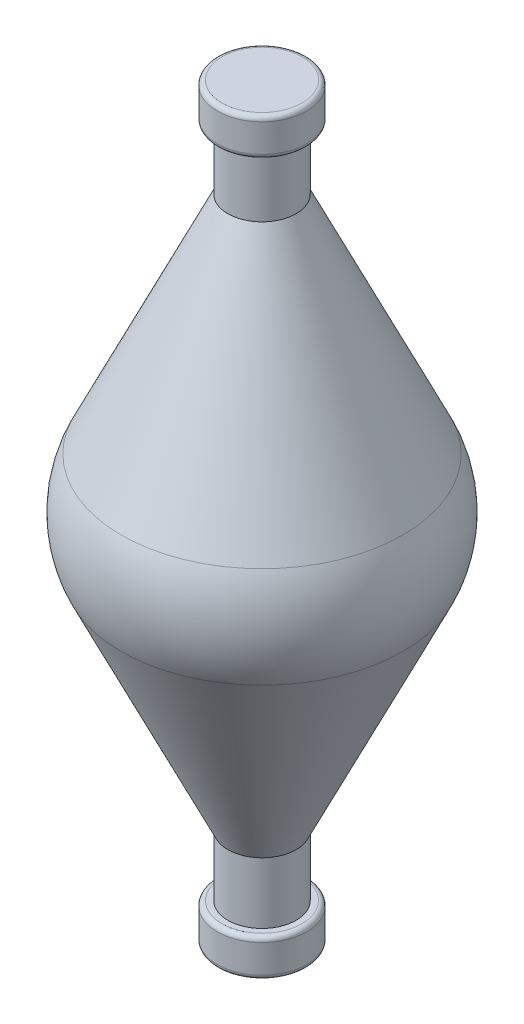
ISO-10303-21;
HEADER;
FILE_DESCRIPTION(('STEP AP214'),'2;1');
FILE_NAME('part.step','',(''),(''),'','','');
FILE_SCHEMA(('AUTOMOTIVE_DESIGN { 1 0 10303 214 1 1 1 1 }'));
ENDSEC;
DATA;
#1=APPLICATION_CONTEXT('core data for automotive mechanical design processes');
#2=APPLICATION_PROTOCOL_DEFINITION('international standard','automotive_design',2000,#1);
#3=PRODUCT_CONTEXT('',#1,'mechanical');
#4=PRODUCT('Part','Part','',(#3));
#5=PRODUCT_RELATED_PRODUCT_CATEGORY('part','',(#4));
#6=PRODUCT_DEFINITION_FORMATION('','',#4);
#7=PRODUCT_DEFINITION_CONTEXT('part definition',#1,'design');
#8=PRODUCT_DEFINITION('design','',#6,#7);
#9=PRODUCT_DEFINITION_SHAPE('','',#8);
#10=(LENGTH_UNIT() NAMED_UNIT(*) SI_UNIT(.MILLI.,.METRE.));
#11=(NAMED_UNIT(*) PLANE_ANGLE_UNIT() SI_UNIT($,.RADIAN.));
#12=(NAMED_UNIT(*) SI_UNIT($,.STERADIAN.) SOLID_ANGLE_UNIT());
#13=UNCERTAINTY_MEASURE_WITH_UNIT(LENGTH_MEASURE(1.E-05),#10,'distance_accuracy_value','');
#14=(GEOMETRIC_REPRESENTATION_CONTEXT(3) GLOBAL_UNCERTAINTY_ASSIGNED_CONTEXT((#13)) GLOBAL_UNIT_ASSIGNED_CONTEXT((#10,
#11,#12)) REPRESENTATION_CONTEXT('',''));
#15=CARTESIAN_POINT('',(0.,0.,0.));
#16=DIRECTION('',(0.,0.,1.));
#17=DIRECTION('',(1.,0.,0.));
#18=AXIS2_PLACEMENT_3D('',#15,#16,#17);
#19=CARTESIAN_POINT('',(0.,15.9,0.));
#20=DIRECTION('',(0.,-1.,0.));
#21=DIRECTION('',(1.,0.,0.));
#22=AXIS2_PLACEMENT_3D('',#19,#20,#21);
#23=PLANE('',#22);
#24=CARTESIAN_POINT('',(0.,15.9,0.));
#25=DIRECTION('',(0.,-1.,0.));
#26=DIRECTION('',(1.,0.,0.));
#27=AXIS2_PLACEMENT_3D('',#24,#25,#26);
#28=CIRCLE('',#27,1.70000000000002);
#29=CARTESIAN_POINT('',(1.70000000000001,15.9,0.));
#30=VERTEX_POINT('',#29);
#31=EDGE_CURVE('E59',#30,#30,#28,.F.);
#32=ORIENTED_EDGE('',*,*,#31,.T.);
#33=EDGE_LOOP('',(#32));
#34=FACE_BOUND('',#33,.T.);
#35=ADVANCED_FACE('F30',(#34),#23,.F.);
#36=CARTESIAN_POINT('',(0.,15.9,0.));
#37=DIRECTION('',(0.,1.,0.));
#38=DIRECTION('',(-1.,0.,0.));
#39=AXIS2_PLACEMENT_3D('',#36,#37,#38);
#40=CYLINDRICAL_SURFACE('',#39,1.90000000000002);
#41=CARTESIAN_POINT('',(0.,15.7,0.));
#42=DIRECTION('',(0.,-1.,0.));
#43=DIRECTION('',(1.,0.,0.));
#44=AXIS2_PLACEMENT_3D('',#41,#42,#43);
#45=CIRCLE('',#44,1.90000000000002);
#46=CARTESIAN_POINT('',(1.90000000000001,15.7,0.));
#47=VERTEX_POINT('',#46);
#48=EDGE_CURVE('E53',#47,#47,#45,.T.);
#49=ORIENTED_EDGE('',*,*,#48,.T.);
#50=EDGE_LOOP('',(#49));
#51=FACE_BOUND('',#50,.T.);
#52=CARTESIAN_POINT('',(0.,14.5,0.));
#53=DIRECTION('',(0.,1.,0.));
#54=DIRECTION('',(-1.,0.,0.));
#55=AXIS2_PLACEMENT_3D('',#52,#53,#54);
#56=CIRCLE('',#55,1.90000000000002);
#57=CARTESIAN_POINT('',(-1.90000000000003,14.5,0.));
#58=VERTEX_POINT('',#57);
#59=EDGE_CURVE('E56',#58,#58,#56,.T.);
#60=ORIENTED_EDGE('',*,*,#59,.T.);
#61=EDGE_LOOP('',(#60));
#62=FACE_BOUND('',#61,.T.);
#63=ADVANCED_FACE('F98',(#51,#62),#40,.T.);
#64=CARTESIAN_POINT('',(1.90000000000001,14.3,0.));
#65=DIRECTION('',(0.,1.,0.));
#66=DIRECTION('',(-1.,0.,0.));
#67=AXIS2_PLACEMENT_3D('',#64,#65,#66);
#68=PLANE('',#67);
#69=CARTESIAN_POINT('',(0.,14.3,0.));
#70=DIRECTION('',(0.,1.,0.));
#71=DIRECTION('',(-1.,0.,0.));
#72=AXIS2_PLACEMENT_3D('',#69,#70,#71);
#73=CIRCLE('',#72,1.70000000000002);
#74=CARTESIAN_POINT('',(-1.70000000000003,14.3,0.));
#75=VERTEX_POINT('',#74);
#76=EDGE_CURVE('E50',#75,#75,#73,.F.);
#77=ORIENTED_EDGE('',*,*,#76,.T.);
#78=EDGE_LOOP('',(#77));
#79=FACE_BOUND('',#78,.T.);
#80=CARTESIAN_POINT('',(0.,14.3,0.));
#81=DIRECTION('',(0.,1.,0.));
#82=DIRECTION('',(-1.,0.,0.));
#83=AXIS2_PLACEMENT_3D('',#80,#81,#82);
#84=CIRCLE('',#83,1.45000000000001);
#85=CARTESIAN_POINT('',(-1.45000000000002,14.3,0.));
#86=VERTEX_POINT('',#85);
#87=EDGE_CURVE('E68',#86,#86,#84,.T.);
#88=ORIENTED_EDGE('',*,*,#87,.T.);
#89=EDGE_LOOP('',(#88));
#90=FACE_BOUND('',#89,.T.);
#91=ADVANCED_FACE('F104',(#79,#90),#68,.F.);
#92=CARTESIAN_POINT('',(0.,15.9,0.));
#93=DIRECTION('',(0.,1.,0.));
#94=DIRECTION('',(-1.,0.,0.));
#95=AXIS2_PLACEMENT_3D('',#92,#93,#94);
#96=CYLINDRICAL_SURFACE('',#95,1.45000000000001);
#97=ORIENTED_EDGE('',*,*,#87,.F.);
#98=EDGE_LOOP('',(#97));
#99=FACE_BOUND('',#98,.T.);
#100=CARTESIAN_POINT('',(0.,11.7,0.));
#101=DIRECTION('',(0.,1.,0.));
#102=DIRECTION('',(-1.,0.,0.));
#103=AXIS2_PLACEMENT_3D('',#100,#101,#102);
#104=CIRCLE('',#103,1.45000000000001);
#105=CARTESIAN_POINT('',(-1.45000000000001,11.7,0.));
#106=VERTEX_POINT('',#105);
#107=EDGE_CURVE('E71',#106,#106,#104,.T.);
#108=ORIENTED_EDGE('',*,*,#107,.T.);
#109=EDGE_LOOP('',(#108));
#110=FACE_BOUND('',#109,.T.);
#111=ADVANCED_FACE('F179',(#99,#110),#96,.T.);
#112=CARTESIAN_POINT('',(0.,0.,0.));
#113=DIRECTION('',(0.,-1.,0.));
#114=DIRECTION('',(1.,0.,0.));
#115=AXIS2_PLACEMENT_3D('',#112,#113,#114);
#116=CONICAL_SURFACE('',#115,7.,0.442925187108321);
#117=CARTESIAN_POINT('',(0.,2.14292103436086,0.));
#118=DIRECTION('',(0.,1.,0.));
#119=DIRECTION('',(-1.,0.,0.));
#120=AXIS2_PLACEMENT_3D('',#117,#118,#119);
#121=CIRCLE('',#120,5.98348617600831);
#122=CARTESIAN_POINT('',(-5.9834861760083,2.14292103436085,0.));
#123=VERTEX_POINT('',#122);
#124=EDGE_CURVE('E65',#123,#123,#121,.T.);
#125=ORIENTED_EDGE('',*,*,#124,.T.);
#126=EDGE_LOOP('',(#125));
#127=FACE_BOUND('',#126,.T.);
#128=ORIENTED_EDGE('',*,*,#107,.F.);
#129=EDGE_LOOP('',(#128));
#130=FACE_BOUND('',#129,.T.);
#131=ADVANCED_FACE('F205',(#127,#130),#116,.T.);
#132=CARTESIAN_POINT('',(0.,-11.7,0.));
#133=DIRECTION('',(0.,1.,0.));
#134=DIRECTION('',(-1.,0.,0.));
#135=AXIS2_PLACEMENT_3D('',#132,#133,#134);
#136=CONICAL_SURFACE('',#135,1.44999999999999,0.442925187108323);
#137=CARTESIAN_POINT('',(0.,-2.14292103436087,0.));
#138=DIRECTION('',(0.,-1.,0.));
#139=DIRECTION('',(1.,0.,0.));
#140=AXIS2_PLACEMENT_3D('',#137,#138,#139);
#141=CIRCLE('',#140,5.9834861760083);
#142=CARTESIAN_POINT('',(5.98348617600831,-2.14292103436087,0.));
#143=VERTEX_POINT('',#142);
#144=EDGE_CURVE('E62',#143,#143,#141,.T.);
#145=ORIENTED_EDGE('',*,*,#144,.T.);
#146=EDGE_LOOP('',(#145));
#147=FACE_BOUND('',#146,.T.);
#148=CARTESIAN_POINT('',(0.,-11.7,0.));
#149=DIRECTION('',(0.,1.,0.));
#150=DIRECTION('',(-1.,0.,0.));
#151=AXIS2_PLACEMENT_3D('',#148,#149,#150);
#152=CIRCLE('',#151,1.44999999999999);
#153=CARTESIAN_POINT('',(-1.44999999999997,-11.7,0.));
#154=VERTEX_POINT('',#153);
#155=EDGE_CURVE('E74',#154,#154,#152,.T.);
#156=ORIENTED_EDGE('',*,*,#155,.T.);
#157=EDGE_LOOP('',(#156));
#158=FACE_BOUND('',#157,.T.);
#159=ADVANCED_FACE('F94',(#147,#158),#136,.T.);
#160=CARTESIAN_POINT('',(0.,15.9,0.));
#161=DIRECTION('',(0.,1.,0.));
#162=DIRECTION('',(-1.,0.,0.));
#163=AXIS2_PLACEMENT_3D('',#160,#161,#162);
#164=CYLINDRICAL_SURFACE('',#163,1.44999999999999);
#165=ORIENTED_EDGE('',*,*,#155,.F.);
#166=EDGE_LOOP('',(#165));
#167=FACE_BOUND('',#166,.T.);
#168=CARTESIAN_POINT('',(0.,-14.3,0.));
#169=DIRECTION('',(0.,1.,0.));
#170=DIRECTION('',(-1.,0.,0.));
#171=AXIS2_PLACEMENT_3D('',#168,#169,#170);
#172=CIRCLE('',#171,1.44999999999999);
#173=CARTESIAN_POINT('',(-1.44999999999997,-14.3,0.));
#174=VERTEX_POINT('',#173);
#175=EDGE_CURVE('E77',#174,#174,#172,.T.);
#176=ORIENTED_EDGE('',*,*,#175,.T.);
#177=EDGE_LOOP('',(#176));
#178=FACE_BOUND('',#177,.T.);
#179=ADVANCED_FACE('F81',(#167,#178),#164,.T.);
#180=CARTESIAN_POINT('',(1.45,-14.3,0.));
#181=DIRECTION('',(0.,-1.,0.));
#182=DIRECTION('',(1.,0.,0.));
#183=AXIS2_PLACEMENT_3D('',#180,#181,#182);
#184=PLANE('',#183);
#185=CARTESIAN_POINT('',(0.,-14.3,0.));
#186=DIRECTION('',(0.,-1.,0.));
#187=DIRECTION('',(1.,0.,0.));
#188=AXIS2_PLACEMENT_3D('',#185,#186,#187);
#189=CIRCLE('',#188,1.7);
#190=CARTESIAN_POINT('',(1.70000000000001,-14.3,0.));
#191=VERTEX_POINT('',#190);
#192=EDGE_CURVE('E10',#191,#191,#189,.F.);
#193=ORIENTED_EDGE('',*,*,#192,.T.);
#194=EDGE_LOOP('',(#193));
#195=FACE_BOUND('',#194,.T.);
#196=ORIENTED_EDGE('',*,*,#175,.F.);
#197=EDGE_LOOP('',(#196));
#198=FACE_BOUND('',#197,.T.);
#199=ADVANCED_FACE('F83',(#195,#198),#184,.F.);
#200=CARTESIAN_POINT('',(0.,15.9,0.));
#201=DIRECTION('',(0.,1.,0.));
#202=DIRECTION('',(-1.,0.,0.));
#203=AXIS2_PLACEMENT_3D('',#200,#201,#202);
#204=CYLINDRICAL_SURFACE('',#203,1.9);
#205=CARTESIAN_POINT('',(0.,-15.7,0.));
#206=DIRECTION('',(0.,1.,0.));
#207=DIRECTION('',(-1.,0.,0.));
#208=AXIS2_PLACEMENT_3D('',#205,#206,#207);
#209=CIRCLE('',#208,1.9);
#210=CARTESIAN_POINT('',(-1.89999999999998,-15.7,0.));
#211=VERTEX_POINT('',#210);
#212=EDGE_CURVE('E41',#211,#211,#209,.T.);
#213=ORIENTED_EDGE('',*,*,#212,.T.);
#214=EDGE_LOOP('',(#213));
#215=FACE_BOUND('',#214,.T.);
#216=CARTESIAN_POINT('',(0.,-14.5,0.));
#217=DIRECTION('',(0.,-1.,0.));
#218=DIRECTION('',(1.,0.,0.));
#219=AXIS2_PLACEMENT_3D('',#216,#217,#218);
#220=CIRCLE('',#219,1.9);
#221=CARTESIAN_POINT('',(1.90000000000001,-14.5,0.));
#222=VERTEX_POINT('',#221);
#223=EDGE_CURVE('E45',#222,#222,#220,.T.);
#224=ORIENTED_EDGE('',*,*,#223,.T.);
#225=EDGE_LOOP('',(#224));
#226=FACE_BOUND('',#225,.T.);
#227=ADVANCED_FACE('F85',(#215,#226),#204,.T.);
#228=CARTESIAN_POINT('',(1.90000000000001,-15.9,0.));
#229=DIRECTION('',(0.,1.,0.));
#230=DIRECTION('',(-1.,0.,0.));
#231=AXIS2_PLACEMENT_3D('',#228,#229,#230);
#232=PLANE('',#231);
#233=CARTESIAN_POINT('',(0.,-15.9,0.));
#234=DIRECTION('',(0.,1.,0.));
#235=DIRECTION('',(-1.,0.,0.));
#236=AXIS2_PLACEMENT_3D('',#233,#234,#235);
#237=CIRCLE('',#236,1.7);
#238=CARTESIAN_POINT('',(-1.69999999999998,-15.9,0.));
#239=VERTEX_POINT('',#238);
#240=EDGE_CURVE('E37',#239,#239,#237,.F.);
#241=ORIENTED_EDGE('',*,*,#240,.T.);
#242=EDGE_LOOP('',(#241));
#243=FACE_BOUND('',#242,.T.);
#244=ADVANCED_FACE('F91',(#243),#232,.F.);
#245=CARTESIAN_POINT('',(0.,0.,0.));
#246=DIRECTION('',(0.,-1.,0.));
#247=DIRECTION('',(1.,0.,0.));
#248=AXIS2_PLACEMENT_3D('',#245,#246,#247);
#249=DEGENERATE_TOROIDAL_SURFACE('',#248,1.46597696843675,5.,.T.);
#250=ORIENTED_EDGE('',*,*,#144,.F.);
#251=EDGE_LOOP('',(#250));
#252=FACE_BOUND('',#251,.T.);
#253=ORIENTED_EDGE('',*,*,#124,.F.);
#254=EDGE_LOOP('',(#253));
#255=FACE_BOUND('',#254,.T.);
#256=ADVANCED_FACE('F109',(#252,#255),#249,.T.);
#257=CARTESIAN_POINT('',(0.,15.7,0.));
#258=DIRECTION('',(0.,-1.,0.));
#259=DIRECTION('',(1.,0.,0.));
#260=AXIS2_PLACEMENT_3D('',#257,#258,#259);
#261=TOROIDAL_SURFACE('',#260,1.70000000000002,0.2);
#262=ORIENTED_EDGE('',*,*,#48,.F.);
#263=EDGE_LOOP('',(#262));
#264=FACE_BOUND('',#263,.T.);
#265=ORIENTED_EDGE('',*,*,#31,.F.);
#266=EDGE_LOOP('',(#265));
#267=FACE_BOUND('',#266,.T.);
#268=ADVANCED_FACE('F112',(#264,#267),#261,.T.);
#269=CARTESIAN_POINT('',(0.,14.5,0.));
#270=DIRECTION('',(0.,1.,0.));
#271=DIRECTION('',(-1.,0.,0.));
#272=AXIS2_PLACEMENT_3D('',#269,#270,#271);
#273=TOROIDAL_SURFACE('',#272,1.70000000000002,0.2);
#274=ORIENTED_EDGE('',*,*,#76,.F.);
#275=EDGE_LOOP('',(#274));
#276=FACE_BOUND('',#275,.T.);
#277=ORIENTED_EDGE('',*,*,#59,.F.);
#278=EDGE_LOOP('',(#277));
#279=FACE_BOUND('',#278,.T.);
#280=ADVANCED_FACE('F116',(#276,#279),#273,.T.);
#281=CARTESIAN_POINT('',(0.,-15.7,0.));
#282=DIRECTION('',(0.,1.,0.));
#283=DIRECTION('',(-1.,0.,0.));
#284=AXIS2_PLACEMENT_3D('',#281,#282,#283);
#285=TOROIDAL_SURFACE('',#284,1.7,0.2);
#286=ORIENTED_EDGE('',*,*,#240,.F.);
#287=EDGE_LOOP('',(#286));
#288=FACE_BOUND('',#287,.T.);
#289=ORIENTED_EDGE('',*,*,#212,.F.);
#290=EDGE_LOOP('',(#289));
#291=FACE_BOUND('',#290,.T.);
#292=ADVANCED_FACE('F119',(#288,#291),#285,.T.);
#293=CARTESIAN_POINT('',(0.,-14.5,0.));
#294=DIRECTION('',(0.,-1.,0.));
#295=DIRECTION('',(1.,0.,0.));
#296=AXIS2_PLACEMENT_3D('',#293,#294,#295);
#297=TOROIDAL_SURFACE('',#296,1.7,0.2);
#298=ORIENTED_EDGE('',*,*,#223,.F.);
#299=EDGE_LOOP('',(#298));
#300=FACE_BOUND('',#299,.T.);
#301=ORIENTED_EDGE('',*,*,#192,.F.);
#302=EDGE_LOOP('',(#301));
#303=FACE_BOUND('',#302,.T.);
#304=ADVANCED_FACE('F32',(#300,#303),#297,.T.);
#305=CLOSED_SHELL('',(#35,#63,#91,#111,#131,#159,#179,#199,#227,#244,#256,#268,#280,#292,#304));
#306=MANIFOLD_SOLID_BREP('B2',#305);
#307=ADVANCED_BREP_SHAPE_REPRESENTATION('',(#18,#306),#14);
#308=SHAPE_DEFINITION_REPRESENTATION(#9,#307);
ENDSEC;
END-ISO-10303-21;
